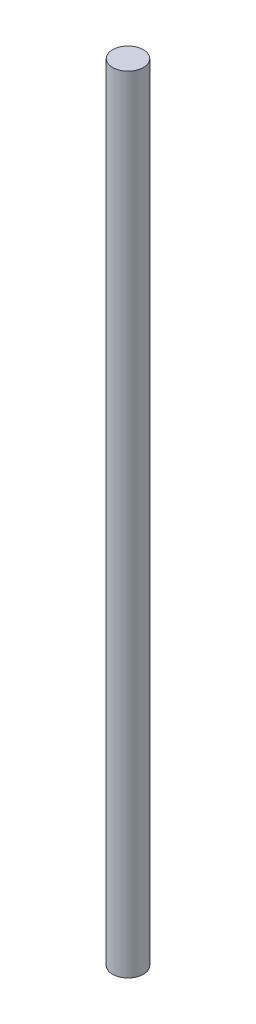
ISO-10303-21;
HEADER;
FILE_DESCRIPTION(('STEP AP214'),'2;1');
FILE_NAME('part.step','',(''),(''),'','','');
FILE_SCHEMA(('AUTOMOTIVE_DESIGN { 1 0 10303 214 1 1 1 1 }'));
ENDSEC;
DATA;
#1=APPLICATION_CONTEXT('core data for automotive mechanical design processes');
#2=APPLICATION_PROTOCOL_DEFINITION('international standard','automotive_design',2000,#1);
#3=PRODUCT_CONTEXT('',#1,'mechanical');
#4=PRODUCT('Part','Part','',(#3));
#5=PRODUCT_RELATED_PRODUCT_CATEGORY('part','',(#4));
#6=PRODUCT_DEFINITION_FORMATION('','',#4);
#7=PRODUCT_DEFINITION_CONTEXT('part definition',#1,'design');
#8=PRODUCT_DEFINITION('design','',#6,#7);
#9=PRODUCT_DEFINITION_SHAPE('','',#8);
#10=(LENGTH_UNIT() NAMED_UNIT(*) SI_UNIT(.MILLI.,.METRE.));
#11=(NAMED_UNIT(*) PLANE_ANGLE_UNIT() SI_UNIT($,.RADIAN.));
#12=(NAMED_UNIT(*) SI_UNIT($,.STERADIAN.) SOLID_ANGLE_UNIT());
#13=UNCERTAINTY_MEASURE_WITH_UNIT(LENGTH_MEASURE(1.E-05),#10,'distance_accuracy_value','');
#14=(GEOMETRIC_REPRESENTATION_CONTEXT(3) GLOBAL_UNCERTAINTY_ASSIGNED_CONTEXT((#13)) GLOBAL_UNIT_ASSIGNED_CONTEXT((#10,
#11,#12)) REPRESENTATION_CONTEXT('',''));
#15=CARTESIAN_POINT('',(0.,0.,0.));
#16=DIRECTION('',(0.,0.,1.));
#17=DIRECTION('',(1.,0.,0.));
#18=AXIS2_PLACEMENT_3D('',#15,#16,#17);
#19=CARTESIAN_POINT('',(0.,161.925,0.));
#20=DIRECTION('',(0.,-1.,0.));
#21=DIRECTION('',(0.,0.,-1.));
#22=AXIS2_PLACEMENT_3D('',#19,#20,#21);
#23=CYLINDRICAL_SURFACE('',#22,3.175);
#24=CARTESIAN_POINT('',(0.,161.925,0.));
#25=DIRECTION('',(0.,1.,0.));
#26=DIRECTION('',(0.,0.,1.));
#27=AXIS2_PLACEMENT_3D('',#24,#25,#26);
#28=CIRCLE('',#27,3.175);
#29=CARTESIAN_POINT('',(0.,161.925,3.175));
#30=VERTEX_POINT('',#29);
#31=EDGE_CURVE('E11',#30,#30,#28,.T.);
#32=ORIENTED_EDGE('',*,*,#31,.F.);
#33=EDGE_LOOP('',(#32));
#34=FACE_BOUND('',#33,.T.);
#35=CARTESIAN_POINT('',(0.,0.,0.));
#36=DIRECTION('',(0.,1.,0.));
#37=DIRECTION('',(0.,0.,1.));
#38=AXIS2_PLACEMENT_3D('',#35,#36,#37);
#39=CIRCLE('',#38,3.175);
#40=CARTESIAN_POINT('',(0.,0.,3.175));
#41=VERTEX_POINT('',#40);
#42=EDGE_CURVE('E35',#41,#41,#39,.T.);
#43=ORIENTED_EDGE('',*,*,#42,.T.);
#44=EDGE_LOOP('',(#43));
#45=FACE_BOUND('',#44,.T.);
#46=ADVANCED_FACE('F32',(#34,#45),#23,.T.);
#47=CARTESIAN_POINT('',(0.,161.925,0.));
#48=DIRECTION('',(0.,1.,0.));
#49=DIRECTION('',(0.,0.,1.));
#50=AXIS2_PLACEMENT_3D('',#47,#48,#49);
#51=PLANE('',#50);
#52=ORIENTED_EDGE('',*,*,#31,.T.);
#53=EDGE_LOOP('',(#52));
#54=FACE_BOUND('',#53,.T.);
#55=ADVANCED_FACE('F61',(#54),#51,.T.);
#56=CARTESIAN_POINT('',(0.,0.,0.));
#57=DIRECTION('',(0.,1.,0.));
#58=DIRECTION('',(0.,0.,1.));
#59=AXIS2_PLACEMENT_3D('',#56,#57,#58);
#60=PLANE('',#59);
#61=CARTESIAN_POINT('',(0.,0.,0.));
#62=DIRECTION('',(0.,-1.,0.));
#63=DIRECTION('',(0.,0.,-1.));
#64=AXIS2_PLACEMENT_3D('',#61,#62,#63);
#65=CIRCLE('',#64,1.47319999999999);
#66=CARTESIAN_POINT('',(0.,0.,-1.47319999999999));
#67=VERTEX_POINT('',#66);
#68=EDGE_CURVE('E51',#67,#67,#65,.T.);
#69=ORIENTED_EDGE('',*,*,#68,.F.);
#70=EDGE_LOOP('',(#69));
#71=FACE_BOUND('',#70,.T.);
#72=ORIENTED_EDGE('',*,*,#42,.F.);
#73=EDGE_LOOP('',(#72));
#74=FACE_BOUND('',#73,.T.);
#75=ADVANCED_FACE('F45',(#71,#74),#60,.F.);
#76=CARTESIAN_POINT('',(0.,3.6576,0.));
#77=DIRECTION('',(0.,-1.,0.));
#78=DIRECTION('',(0.,0.,-1.));
#79=AXIS2_PLACEMENT_3D('',#76,#77,#78);
#80=CONICAL_SURFACE('',#79,1.4732,1.02974425867665);
#81=CARTESIAN_POINT('',(0.,4.5427878639514,0.));
#82=VERTEX_POINT('',#81);
#83=VERTEX_LOOP('',#82);
#84=FACE_BOUND('',#83,.T.);
#85=CARTESIAN_POINT('',(0.,3.6576,0.));
#86=DIRECTION('',(0.,-1.,0.));
#87=DIRECTION('',(0.,0.,-1.));
#88=AXIS2_PLACEMENT_3D('',#85,#86,#87);
#89=CIRCLE('',#88,1.4732);
#90=CARTESIAN_POINT('',(0.,3.6576,-1.4732));
#91=VERTEX_POINT('',#90);
#92=EDGE_CURVE('E49',#91,#91,#89,.T.);
#93=ORIENTED_EDGE('',*,*,#92,.T.);
#94=EDGE_LOOP('',(#93));
#95=FACE_BOUND('',#94,.T.);
#96=ADVANCED_FACE('F41',(#84,#95),#80,.F.);
#97=CARTESIAN_POINT('',(0.,0.,0.));
#98=DIRECTION('',(0.,-1.,0.));
#99=DIRECTION('',(0.,0.,-1.));
#100=AXIS2_PLACEMENT_3D('',#97,#98,#99);
#101=CYLINDRICAL_SURFACE('',#100,1.47319999999999);
#102=ORIENTED_EDGE('',*,*,#92,.F.);
#103=EDGE_LOOP('',(#102));
#104=FACE_BOUND('',#103,.T.);
#105=ORIENTED_EDGE('',*,*,#68,.T.);
#106=EDGE_LOOP('',(#105));
#107=FACE_BOUND('',#106,.T.);
#108=ADVANCED_FACE('F44',(#104,#107),#101,.F.);
#109=CLOSED_SHELL('',(#46,#55,#75,#96,#108));
#110=MANIFOLD_SOLID_BREP('B2',#109);
#111=ADVANCED_BREP_SHAPE_REPRESENTATION('',(#18,#110),#14);
#112=SHAPE_DEFINITION_REPRESENTATION(#9,#111);
ENDSEC;
END-ISO-10303-21;
